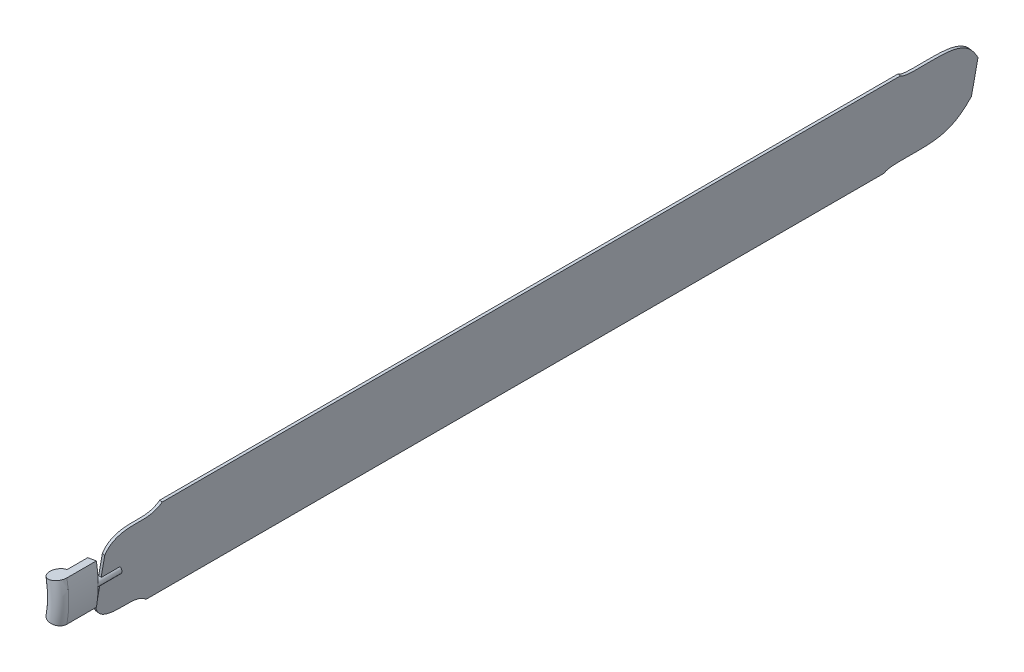
ISO-10303-21;
HEADER;
FILE_DESCRIPTION(('STEP AP214'),'2;1');
FILE_NAME('part.step','',(''),(''),'','','');
FILE_SCHEMA(('AUTOMOTIVE_DESIGN { 1 0 10303 214 1 1 1 1 }'));
ENDSEC;
DATA;
#1=APPLICATION_CONTEXT('core data for automotive mechanical design processes');
#2=APPLICATION_PROTOCOL_DEFINITION('international standard','automotive_design',2000,#1);
#3=PRODUCT_CONTEXT('',#1,'mechanical');
#4=PRODUCT('Part','Part','',(#3));
#5=PRODUCT_RELATED_PRODUCT_CATEGORY('part','',(#4));
#6=PRODUCT_DEFINITION_FORMATION('','',#4);
#7=PRODUCT_DEFINITION_CONTEXT('part definition',#1,'design');
#8=PRODUCT_DEFINITION('design','',#6,#7);
#9=PRODUCT_DEFINITION_SHAPE('','',#8);
#10=(LENGTH_UNIT() NAMED_UNIT(*) SI_UNIT(.MILLI.,.METRE.));
#11=(NAMED_UNIT(*) PLANE_ANGLE_UNIT() SI_UNIT($,.RADIAN.));
#12=(NAMED_UNIT(*) SI_UNIT($,.STERADIAN.) SOLID_ANGLE_UNIT());
#13=UNCERTAINTY_MEASURE_WITH_UNIT(LENGTH_MEASURE(1.E-05),#10,'distance_accuracy_value','');
#14=(GEOMETRIC_REPRESENTATION_CONTEXT(3) GLOBAL_UNCERTAINTY_ASSIGNED_CONTEXT((#13)) GLOBAL_UNIT_ASSIGNED_CONTEXT((#10,
#11,#12)) REPRESENTATION_CONTEXT('',''));
#15=CARTESIAN_POINT('',(0.,0.,0.));
#16=DIRECTION('',(0.,0.,1.));
#17=DIRECTION('',(1.,0.,0.));
#18=AXIS2_PLACEMENT_3D('',#15,#16,#17);
#19=CARTESIAN_POINT('',(45.8916588229934,29.4562575543292,16.4977824517042));
#20=DIRECTION('',(-0.984807753012209,0.173648177666928,0.));
#21=DIRECTION('',(-0.173648177666928,-0.984807753012209,0.));
#22=AXIS2_PLACEMENT_3D('',#19,#20,#21);
#23=PLANE('',#22);
#24=CARTESIAN_POINT('',(41.0814453886609,2.17618155571783,-351.502217548296));
#25=CARTESIAN_POINT('',(40.0405630877971,-3.72695531353289,-347.967875432127));
#26=CARTESIAN_POINT('',(38.4755583622352,-12.602538161228,-336.774418039819));
#27=CARTESIAN_POINT('',(39.9916376862148,-4.00442505404396,-305.302673092351));
#28=CARTESIAN_POINT('',(37.3452628748744,-19.0127624094933,-323.695897101064));
#29=B_SPLINE_CURVE_WITH_KNOTS('',3,(#24,#25,#26,#27,#28),.UNSPECIFIED.,.F.,.F.,(4,1,4),(0.,
0.348264383579403,1.),.UNSPECIFIED.);
#30=CARTESIAN_POINT('',(39.0236725336993,-9.49402822552852,-316.754779296154));
#31=VERTEX_POINT('',#30);
#32=CARTESIAN_POINT('',(41.0814453886609,2.17618155571783,-351.502217548296));
#33=VERTEX_POINT('',#32);
#34=EDGE_CURVE('E151',#31,#33,#29,.F.);
#35=ORIENTED_EDGE('',*,*,#34,.F.);
#36=DIRECTION('',(0.,0.,-1.));
#37=VECTOR('',#36,1.);
#38=CARTESIAN_POINT('',(39.0236725336993,-9.49402822552851,16.4977824517042));
#39=LINE('',#38,#37);
#40=CARTESIAN_POINT('',(39.0236725336993,-9.49402822552851,-6.10081257353363));
#41=VERTEX_POINT('',#40);
#42=EDGE_CURVE('E161',#41,#31,#39,.T.);
#43=ORIENTED_EDGE('',*,*,#42,.F.);
#44=CARTESIAN_POINT('',(40.5945146896673,-0.585339664897899,16.4977824517042));
#45=CARTESIAN_POINT('',(39.8668225466336,-4.71228688596365,15.1194466914543));
#46=CARTESIAN_POINT('',(39.4798316785515,-6.90702116047601,9.53361709706314));
#47=CARTESIAN_POINT('',(39.5488932591807,-6.5153534738195,2.34707738003175));
#48=CARTESIAN_POINT('',(39.4875434939874,-6.86328528179826,-2.58281750213995));
#49=CARTESIAN_POINT('',(38.8097567093769,-10.707205150937,-8.59504402973436));
#50=CARTESIAN_POINT('',(37.6367571009915,-17.3596165043915,-9.39942359034055));
#51=CARTESIAN_POINT('',(37.8995653008962,-15.8691571382258,-14.8364224951667));
#52=B_SPLINE_CURVE_WITH_KNOTS('',3,(#44,#45,#46,#47,#48,#49,#50,#51),.UNSPECIFIED.,.F.,.F.,(4,1,
1,1,1,4),(0.,0.299327732966461,0.443712894108735,0.582270155448302,0.686413384621787,1.),.UNSPECIFIED.);
#53=CARTESIAN_POINT('',(40.5945146896673,-0.585339664897808,16.4977824517042));
#54=VERTEX_POINT('',#53);
#55=EDGE_CURVE('E295',#41,#54,#52,.F.);
#56=ORIENTED_EDGE('',*,*,#55,.T.);
#57=DIRECTION('',(0.173648177666928,0.984807753012209,0.));
#58=VECTOR('',#57,1.);
#59=CARTESIAN_POINT('',(45.8916588229934,29.4562575543292,16.4977824517042));
#60=LINE('',#59,#58);
#61=CARTESIAN_POINT('',(42.2408611771756,8.75155523849963,16.4977824517042));
#62=VERTEX_POINT('',#61);
#63=EDGE_CURVE('E320',#54,#62,#60,.T.);
#64=ORIENTED_EDGE('',*,*,#63,.T.);
#65=DIRECTION('',(0.,0.,1.));
#66=VECTOR('',#65,1.);
#67=CARTESIAN_POINT('',(42.2408611771756,8.75155523849963,8.49778245170418));
#68=LINE('',#67,#66);
#69=CARTESIAN_POINT('',(42.2408611771756,8.75155523849963,8.49778245170418));
#70=VERTEX_POINT('',#69);
#71=EDGE_CURVE('E190',#70,#62,#68,.T.);
#72=ORIENTED_EDGE('',*,*,#71,.F.);
#73=DIRECTION('',(0.173648177666928,0.984807753012209,0.));
#74=VECTOR('',#73,1.);
#75=CARTESIAN_POINT('',(42.0636766257408,7.74669171322977,8.49778245170418));
#76=LINE('',#75,#74);
#77=CARTESIAN_POINT('',(42.7524109969001,11.6526984309317,8.49778245170418));
#78=VERTEX_POINT('',#77);
#79=EDGE_CURVE('E236',#70,#78,#76,.T.);
#80=ORIENTED_EDGE('',*,*,#79,.T.);
#81=DIRECTION('',(0.,0.,1.));
#82=VECTOR('',#81,1.);
#83=CARTESIAN_POINT('',(42.7524109969001,11.6526984309317,8.49778245170418));
#84=LINE('',#83,#82);
#85=CARTESIAN_POINT('',(42.7524109969001,11.6526984309317,16.4977824517042));
#86=VERTEX_POINT('',#85);
#87=EDGE_CURVE('E188',#86,#78,#84,.F.);
#88=ORIENTED_EDGE('',*,*,#87,.F.);
#89=CARTESIAN_POINT('',(44.3208166670253,20.5475689936984,16.4977824517042));
#90=VERTEX_POINT('',#89);
#91=EDGE_CURVE('E319',#86,#90,#60,.T.);
#92=ORIENTED_EDGE('',*,*,#91,.T.);
#93=CARTESIAN_POINT('',(44.3208166670253,20.5475689936985,16.4977824517042));
#94=CARTESIAN_POINT('',(45.048508810059,24.6745162147642,15.1194466914543));
#95=CARTESIAN_POINT('',(45.4354996781412,26.8692504892766,9.53361709706314));
#96=CARTESIAN_POINT('',(45.366438097512,26.4775828026201,2.34707738003175));
#97=CARTESIAN_POINT('',(45.4277878627053,26.8255146105988,-2.58281750213995));
#98=CARTESIAN_POINT('',(46.1055746473158,30.6694344797376,-8.59504402973435));
#99=CARTESIAN_POINT('',(47.2785742557011,37.321845833192,-9.39942359034055));
#100=CARTESIAN_POINT('',(47.0157660557965,35.8313864670263,-14.8364224951667));
#101=B_SPLINE_CURVE_WITH_KNOTS('',3,(#93,#94,#95,#96,#97,#98,#99,#100),.UNSPECIFIED.,.F.,.F.,(4,
1,1,1,1,4),(0.,0.299327732966461,0.443712894108735,0.582270155448302,0.686413384621787,1.),.UNSPECIFIED.);
#102=CARTESIAN_POINT('',(45.8916588229934,29.4562575543292,-6.10081257353379));
#103=VERTEX_POINT('',#102);
#104=EDGE_CURVE('E307',#103,#90,#101,.F.);
#105=ORIENTED_EDGE('',*,*,#104,.F.);
#106=DIRECTION('',(0.,0.,-1.));
#107=VECTOR('',#106,1.);
#108=CARTESIAN_POINT('',(45.8916588229934,29.4562575543292,16.4977824517042));
#109=LINE('',#108,#107);
#110=CARTESIAN_POINT('',(45.8916588229934,29.4562575543292,-316.754779296154));
#111=VERTEX_POINT('',#110);
#112=EDGE_CURVE('E183',#103,#111,#109,.T.);
#113=ORIENTED_EDGE('',*,*,#112,.T.);
#114=CARTESIAN_POINT('',(43.8338859680318,17.7860477730828,-351.502217548296));
#115=CARTESIAN_POINT('',(44.8747682688956,23.6891846423336,-347.967875432127));
#116=CARTESIAN_POINT('',(46.4397729944575,32.5647674900287,-336.774418039819));
#117=CARTESIAN_POINT('',(44.9236936704779,23.9666543828446,-305.302673092351));
#118=CARTESIAN_POINT('',(47.5700684818183,38.9749917382939,-323.695897101064));
#119=B_SPLINE_CURVE_WITH_KNOTS('',3,(#114,#115,#116,#117,#118),.UNSPECIFIED.,.F.,.F.,(4,1,4),
(0.,0.348264383579403,1.),.UNSPECIFIED.);
#120=CARTESIAN_POINT('',(43.8338859680318,17.7860477730828,-351.502217548296));
#121=VERTEX_POINT('',#120);
#122=EDGE_CURVE('E245',#111,#121,#119,.F.);
#123=ORIENTED_EDGE('',*,*,#122,.T.);
#124=DIRECTION('',(0.173648177666928,0.984807753012209,0.));
#125=VECTOR('',#124,1.);
#126=CARTESIAN_POINT('',(45.8916588229934,29.4562575543292,-351.502217548296));
#127=LINE('',#126,#125);
#128=EDGE_CURVE('E163',#33,#121,#127,.T.);
#129=ORIENTED_EDGE('',*,*,#128,.F.);
#130=EDGE_LOOP('',(#35,#43,#56,#64,#72,#80,#88,#92,#105,#113,#123,#129));
#131=FACE_BOUND('',#130,.T.);
#132=ADVANCED_FACE('F36',(#131),#23,.T.);
#133=CARTESIAN_POINT('',(46.9154369846971,29.2757378421607,16.4977824517042));
#134=DIRECTION('',(0.984807753012209,-0.173648177666928,0.));
#135=DIRECTION('',(0.173648177666928,0.984807753012209,0.));
#136=AXIS2_PLACEMENT_3D('',#133,#134,#135);
#137=PLANE('',#136);
#138=CARTESIAN_POINT('',(42.1052235503646,1.99566184354936,-351.502217548296));
#139=CARTESIAN_POINT('',(41.0643412495008,-3.90747502570137,-347.967875432127));
#140=CARTESIAN_POINT('',(39.4993365239389,-12.7830578733965,-336.774418039819));
#141=CARTESIAN_POINT('',(41.0154158479185,-4.18494476621244,-305.302673092351));
#142=CARTESIAN_POINT('',(38.3690410365781,-19.1932821216617,-323.695897101064));
#143=B_SPLINE_CURVE_WITH_KNOTS('',3,(#138,#139,#140,#141,#142),.UNSPECIFIED.,.F.,.F.,(4,1,4),
(0.,0.348264383579403,1.),.UNSPECIFIED.);
#144=CARTESIAN_POINT('',(42.1052235503646,1.99566184354935,-351.502217548296));
#145=VERTEX_POINT('',#144);
#146=CARTESIAN_POINT('',(40.047450695403,-9.67454793769699,-316.75477929177));
#147=VERTEX_POINT('',#146);
#148=EDGE_CURVE('E50',#145,#147,#143,.T.);
#149=ORIENTED_EDGE('',*,*,#148,.F.);
#150=DIRECTION('',(-0.173648177666928,-0.984807753012208,0.));
#151=VECTOR('',#150,1.);
#152=CARTESIAN_POINT('',(46.9154369846971,29.2757378421607,-351.502217548296));
#153=LINE('',#152,#151);
#154=CARTESIAN_POINT('',(44.8576641297356,17.6055280609143,-351.502217548296));
#155=VERTEX_POINT('',#154);
#156=EDGE_CURVE('E318',#155,#145,#153,.T.);
#157=ORIENTED_EDGE('',*,*,#156,.F.);
#158=CARTESIAN_POINT('',(44.8576641297356,17.6055280609143,-351.502217548296));
#159=CARTESIAN_POINT('',(45.8985464305994,23.5086649301651,-347.967875432127));
#160=CARTESIAN_POINT('',(47.4635511561612,32.3842477778602,-336.774418039819));
#161=CARTESIAN_POINT('',(45.9474718321816,23.7861346706761,-305.302673092351));
#162=CARTESIAN_POINT('',(48.593846643522,38.7944720261254,-323.695897101064));
#163=B_SPLINE_CURVE_WITH_KNOTS('',3,(#158,#159,#160,#161,#162),.UNSPECIFIED.,.F.,.F.,(4,1,4),
(0.,0.348264383579403,1.),.UNSPECIFIED.);
#164=CARTESIAN_POINT('',(46.9154369846971,29.2757378421607,-316.754779296154));
#165=VERTEX_POINT('',#164);
#166=EDGE_CURVE('E58',#155,#165,#163,.T.);
#167=ORIENTED_EDGE('',*,*,#166,.T.);
#168=DIRECTION('',(0.,0.,-1.));
#169=VECTOR('',#168,1.);
#170=CARTESIAN_POINT('',(46.9154369846971,29.2757378421607,16.4977824517042));
#171=LINE('',#170,#169);
#172=CARTESIAN_POINT('',(46.9154369846971,29.2757378421607,-6.10081257353374));
#173=VERTEX_POINT('',#172);
#174=EDGE_CURVE('E175',#173,#165,#171,.T.);
#175=ORIENTED_EDGE('',*,*,#174,.F.);
#176=CARTESIAN_POINT('',(45.3445948287291,20.36704928153,16.4977824517042));
#177=CARTESIAN_POINT('',(46.0722869717628,24.4939965025957,15.1194466914543));
#178=CARTESIAN_POINT('',(46.4592778398449,26.6887307771081,9.53361709706314));
#179=CARTESIAN_POINT('',(46.3902162592157,26.2970630904516,2.34707738003175));
#180=CARTESIAN_POINT('',(46.451566024409,26.6449948984303,-2.58281750213995));
#181=CARTESIAN_POINT('',(47.1293528090195,30.4889147675691,-8.59504402973435));
#182=CARTESIAN_POINT('',(48.3023524174049,37.1413261210236,-9.39942359034055));
#183=CARTESIAN_POINT('',(48.0395442175002,35.6508667548579,-14.8364224951667));
#184=B_SPLINE_CURVE_WITH_KNOTS('',3,(#176,#177,#178,#179,#180,#181,#182,#183),.UNSPECIFIED.,.F.,
.F.,(4,1,1,1,1,4),(0.,0.299327732966461,0.443712894108735,0.582270155448302,0.686413384621787,
1.),.UNSPECIFIED.);
#185=CARTESIAN_POINT('',(45.3445948287291,20.36704928153,16.4977824517042));
#186=VERTEX_POINT('',#185);
#187=EDGE_CURVE('E303',#186,#173,#184,.T.);
#188=ORIENTED_EDGE('',*,*,#187,.F.);
#189=DIRECTION('',(-0.173648177666928,-0.984807753012208,0.));
#190=VECTOR('',#189,1.);
#191=CARTESIAN_POINT('',(46.9154369846971,29.2757378421607,16.4977824517042));
#192=LINE('',#191,#190);
#193=CARTESIAN_POINT('',(43.773752672761,11.4583607208993,16.4977824517042));
#194=VERTEX_POINT('',#193);
#195=EDGE_CURVE('E178',#186,#194,#192,.T.);
#196=ORIENTED_EDGE('',*,*,#195,.T.);
#197=DIRECTION('',(0.,0.,1.));
#198=VECTOR('',#197,1.);
#199=CARTESIAN_POINT('',(43.773752672761,11.4583607208993,8.49778245170418));
#200=LINE('',#199,#198);
#201=CARTESIAN_POINT('',(43.773752672761,11.4583607208993,8.49778245170418));
#202=VERTEX_POINT('',#201);
#203=EDGE_CURVE('E173',#202,#194,#200,.T.);
#204=ORIENTED_EDGE('',*,*,#203,.F.);
#205=DIRECTION('',(-0.173648177666928,-0.984807753012209,0.));
#206=VECTOR('',#205,1.);
#207=CARTESIAN_POINT('',(43.0874547874445,7.56617200106129,8.49778245170418));
#208=LINE('',#207,#206);
#209=CARTESIAN_POINT('',(43.2670758247222,8.58485352419509,8.49778245170418));
#210=VERTEX_POINT('',#209);
#211=EDGE_CURVE('E233',#202,#210,#208,.T.);
#212=ORIENTED_EDGE('',*,*,#211,.T.);
#213=DIRECTION('',(0.,0.,1.));
#214=VECTOR('',#213,1.);
#215=CARTESIAN_POINT('',(43.2670758247222,8.58485352419509,8.49778245170418));
#216=LINE('',#215,#214);
#217=CARTESIAN_POINT('',(43.2670758247222,8.58485352419509,16.4977824517042));
#218=VERTEX_POINT('',#217);
#219=EDGE_CURVE('E169',#218,#210,#216,.F.);
#220=ORIENTED_EDGE('',*,*,#219,.F.);
#221=CARTESIAN_POINT('',(41.6182928513711,-0.765859377066286,16.4977824517042));
#222=VERTEX_POINT('',#221);
#223=EDGE_CURVE('E321',#218,#222,#192,.T.);
#224=ORIENTED_EDGE('',*,*,#223,.T.);
#225=CARTESIAN_POINT('',(41.6182928513711,-0.765859377066376,16.4977824517042));
#226=CARTESIAN_POINT('',(40.8906007083374,-4.89280659813213,15.1194466914543));
#227=CARTESIAN_POINT('',(40.5036098402552,-7.08754087264449,9.53361709706314));
#228=CARTESIAN_POINT('',(40.5726714208844,-6.69587318598797,2.34707738003175));
#229=CARTESIAN_POINT('',(40.5113216556911,-7.04380499396673,-2.58281750213995));
#230=CARTESIAN_POINT('',(39.8335348710806,-10.8877248631055,-8.59504402973436));
#231=CARTESIAN_POINT('',(38.6605352626953,-17.54013621656,-9.39942359034055));
#232=CARTESIAN_POINT('',(38.9233434625999,-16.0496768503942,-14.8364224951667));
#233=B_SPLINE_CURVE_WITH_KNOTS('',3,(#225,#226,#227,#228,#229,#230,#231,#232),.UNSPECIFIED.,.F.,
.F.,(4,1,1,1,1,4),(0.,0.299327732966461,0.443712894108735,0.582270155448302,0.686413384621787,
1.),.UNSPECIFIED.);
#234=CARTESIAN_POINT('',(40.047450695403,-9.67454793769699,-6.10081257353379));
#235=VERTEX_POINT('',#234);
#236=EDGE_CURVE('E255',#222,#235,#233,.T.);
#237=ORIENTED_EDGE('',*,*,#236,.T.);
#238=DIRECTION('',(0.,0.,-1.));
#239=VECTOR('',#238,1.);
#240=CARTESIAN_POINT('',(40.047450695403,-9.67454793769699,16.4977824517042));
#241=LINE('',#240,#239);
#242=EDGE_CURVE('E170',#235,#147,#241,.T.);
#243=ORIENTED_EDGE('',*,*,#242,.T.);
#244=EDGE_LOOP('',(#149,#157,#167,#175,#188,#196,#204,#212,#220,#224,#237,#243));
#245=FACE_BOUND('',#244,.T.);
#246=ADVANCED_FACE('F336',(#245),#137,.T.);
#247=CARTESIAN_POINT('',(45.8916588229934,29.4562575543292,16.4977824517042));
#248=DIRECTION('',(0.173648177666925,0.984807753012209,0.));
#249=DIRECTION('',(-0.984807753012209,0.173648177666925,0.));
#250=AXIS2_PLACEMENT_3D('',#247,#248,#249);
#251=PLANE('',#250);
#252=ORIENTED_EDGE('',*,*,#174,.T.);
#253=DIRECTION('',(0.984807753012209,-0.173648177666928,0.));
#254=VECTOR('',#253,1.);
#255=CARTESIAN_POINT('',(36.8188819741008,31.056032902736,-316.754779296154));
#256=LINE('',#255,#254);
#257=EDGE_CURVE('E164',#111,#165,#256,.T.);
#258=ORIENTED_EDGE('',*,*,#257,.F.);
#259=ORIENTED_EDGE('',*,*,#112,.F.);
#260=DIRECTION('',(0.984807753012208,-0.173648177666928,0.));
#261=VECTOR('',#260,1.);
#262=CARTESIAN_POINT('',(36.8188819741008,31.056032902736,-6.10081257353374));
#263=LINE('',#262,#261);
#264=EDGE_CURVE('E242',#173,#103,#263,.F.);
#265=ORIENTED_EDGE('',*,*,#264,.F.);
#266=EDGE_LOOP('',(#252,#258,#259,#265));
#267=FACE_BOUND('',#266,.T.);
#268=ADVANCED_FACE('F339',(#267),#251,.T.);
#269=CARTESIAN_POINT('',(39.0236725336993,-9.49402822552851,-351.502217548296));
#270=DIRECTION('',(0.,0.,1.));
#271=DIRECTION('',(1.,0.,0.));
#272=AXIS2_PLACEMENT_3D('',#269,#270,#271);
#273=PLANE('',#272);
#274=ORIENTED_EDGE('',*,*,#156,.T.);
#275=DIRECTION('',(0.984807753012209,-0.173648177666928,0.));
#276=VECTOR('',#275,1.);
#277=CARTESIAN_POINT('',(32.0086685397683,3.7759569041247,-351.502217548296));
#278=LINE('',#277,#276);
#279=EDGE_CURVE('E355',#33,#145,#278,.T.);
#280=ORIENTED_EDGE('',*,*,#279,.F.);
#281=ORIENTED_EDGE('',*,*,#128,.T.);
#282=DIRECTION('',(0.984807753012209,-0.173648177666928,0.));
#283=VECTOR('',#282,1.);
#284=CARTESIAN_POINT('',(34.7611091191392,19.3858231214897,-351.502217548296));
#285=LINE('',#284,#283);
#286=EDGE_CURVE('E44',#155,#121,#285,.F.);
#287=ORIENTED_EDGE('',*,*,#286,.F.);
#288=EDGE_LOOP('',(#274,#280,#281,#287));
#289=FACE_BOUND('',#288,.T.);
#290=ADVANCED_FACE('F288',(#289),#273,.F.);
#291=CARTESIAN_POINT('',(39.0236725336993,-9.49402822552851,16.4977824517042));
#292=DIRECTION('',(0.,0.,1.));
#293=DIRECTION('',(1.,0.,0.));
#294=AXIS2_PLACEMENT_3D('',#291,#292,#293);
#295=PLANE('',#294);
#296=ORIENTED_EDGE('',*,*,#63,.F.);
#297=DIRECTION('',(0.984807753012208,-0.173648177666928,0.));
#298=VECTOR('',#297,1.);
#299=CARTESIAN_POINT('',(31.5217378407748,1.01443568350906,16.4977824517042));
#300=LINE('',#299,#298);
#301=EDGE_CURVE('E252',#54,#222,#300,.T.);
#302=ORIENTED_EDGE('',*,*,#301,.T.);
#303=ORIENTED_EDGE('',*,*,#223,.F.);
#304=CARTESIAN_POINT('',(42.989039963544,10.1153027458822,16.4977824517042));
#305=DIRECTION('',(0.,0.,1.));
#306=DIRECTION('',(1.,0.,0.));
#307=AXIS2_PLACEMENT_3D('',#304,#305,#306);
#308=CIRCLE('',#307,1.55549952113903);
#309=EDGE_CURVE('E239',#62,#218,#308,.T.);
#310=ORIENTED_EDGE('',*,*,#309,.F.);
#311=EDGE_LOOP('',(#296,#302,#303,#310));
#312=FACE_BOUND('',#311,.T.);
#313=ADVANCED_FACE('F441',(#312),#295,.T.);
#314=CARTESIAN_POINT('',(39.0236725336993,-9.49402822552851,16.4977824517042));
#315=DIRECTION('',(-0.173648177666936,-0.984807753012207,0.));
#316=DIRECTION('',(0.984807753012207,-0.173648177666936,0.));
#317=AXIS2_PLACEMENT_3D('',#314,#315,#316);
#318=PLANE('',#317);
#319=DIRECTION('',(0.984807753012209,-0.173648177666928,0.));
#320=VECTOR('',#319,1.);
#321=CARTESIAN_POINT('',(29.9508956848068,-7.89425287712157,-316.75477929177));
#322=LINE('',#321,#320);
#323=EDGE_CURVE('E11',#147,#31,#322,.F.);
#324=ORIENTED_EDGE('',*,*,#323,.F.);
#325=ORIENTED_EDGE('',*,*,#242,.F.);
#326=DIRECTION('',(0.984807753012208,-0.173648177666928,0.));
#327=VECTOR('',#326,1.);
#328=CARTESIAN_POINT('',(29.9508956848068,-7.89425287712157,-6.10081257353363));
#329=LINE('',#328,#327);
#330=EDGE_CURVE('E168',#235,#41,#329,.F.);
#331=ORIENTED_EDGE('',*,*,#330,.T.);
#332=ORIENTED_EDGE('',*,*,#42,.T.);
#333=EDGE_LOOP('',(#324,#325,#331,#332));
#334=FACE_BOUND('',#333,.T.);
#335=ADVANCED_FACE('F167',(#334),#318,.T.);
#336=CARTESIAN_POINT('',(28.6306159385128,10.1153027458822,8.49778245170418));
#337=DIRECTION('',(0.,0.,-1.));
#338=DIRECTION('',(-1.,0.,0.));
#339=AXIS2_PLACEMENT_3D('',#336,#337,#338);
#340=PLANE('',#339);
#341=ORIENTED_EDGE('',*,*,#79,.F.);
#342=CARTESIAN_POINT('',(42.989039963544,10.1153027458822,8.49778245170418));
#343=DIRECTION('',(0.,0.,-1.));
#344=DIRECTION('',(-1.,0.,0.));
#345=AXIS2_PLACEMENT_3D('',#342,#343,#344);
#346=CIRCLE('',#345,1.55549952113903);
#347=EDGE_CURVE('E194',#70,#78,#346,.T.);
#348=ORIENTED_EDGE('',*,*,#347,.T.);
#349=EDGE_LOOP('',(#341,#348));
#350=FACE_BOUND('',#349,.T.);
#351=ADVANCED_FACE('F383',(#350),#340,.T.);
#352=CARTESIAN_POINT('',(-4.14553428484692,10.1153027458822,30.8848019131057));
#353=DIRECTION('',(0.,0.,1.));
#354=DIRECTION('',(1.,0.,0.));
#355=AXIS2_PLACEMENT_3D('',#352,#353,#354);
#356=TOROIDAL_SURFACE('',#355,44.9999985143405,3.69007525518944);
#357=CARTESIAN_POINT('',(-4.14553428484691,10.1153027458822,30.8848019131057));
#358=DIRECTION('',(0.,0.,1.));
#359=DIRECTION('',(1.,0.,0.));
#360=AXIS2_PLACEMENT_3D('',#357,#358,#359);
#361=CIRCLE('',#360,48.6900737695299);
#362=CARTESIAN_POINT('',(43.8048278581225,1.6603601653349,30.8848019131057));
#363=VERTEX_POINT('',#362);
#364=CARTESIAN_POINT('',(43.8048278581225,18.5702453264295,30.8848019131057));
#365=VERTEX_POINT('',#364);
#366=EDGE_CURVE('E231',#363,#365,#361,.T.);
#367=ORIENTED_EDGE('',*,*,#366,.T.);
#368=CARTESIAN_POINT('',(40.1708131376134,17.929470482912,30.8848019131057));
#369=DIRECTION('',(-0.173648177666931,0.984807753012208,0.));
#370=DIRECTION('',(0.,0.,1.));
#371=AXIS2_PLACEMENT_3D('',#368,#369,#370);
#372=CIRCLE('',#371,3.69007525518944);
#373=CARTESIAN_POINT('',(40.1708131376134,17.929470482912,27.1947266579162));
#374=VERTEX_POINT('',#373);
#375=EDGE_CURVE('E200',#374,#365,#372,.T.);
#376=ORIENTED_EDGE('',*,*,#375,.F.);
#377=CARTESIAN_POINT('',(-4.14553428484691,10.1153027458822,27.1947266579163));
#378=DIRECTION('',(0.,0.,1.));
#379=DIRECTION('',(1.,0.,0.));
#380=AXIS2_PLACEMENT_3D('',#377,#378,#379);
#381=CIRCLE('',#380,44.9999985143405);
#382=CARTESIAN_POINT('',(40.1708131376134,2.30113500885238,27.1947266579162));
#383=VERTEX_POINT('',#382);
#384=EDGE_CURVE('E224',#383,#374,#381,.T.);
#385=ORIENTED_EDGE('',*,*,#384,.F.);
#386=CARTESIAN_POINT('',(40.1708131376134,2.30113500885238,30.8848019131057));
#387=DIRECTION('',(0.173648177666931,0.984807753012208,0.));
#388=DIRECTION('',(0.,0.,1.));
#389=AXIS2_PLACEMENT_3D('',#386,#387,#388);
#390=CIRCLE('',#389,3.69007525518944);
#391=EDGE_CURVE('E212',#383,#363,#390,.T.);
#392=ORIENTED_EDGE('',*,*,#391,.T.);
#393=EDGE_LOOP('',(#367,#376,#385,#392));
#394=FACE_BOUND('',#393,.T.);
#395=ADVANCED_FACE('F397',(#394),#356,.T.);
#396=CARTESIAN_POINT('',(-4.14553428484691,10.1153027458822,34.5848019131057));
#397=DIRECTION('',(0.,0.,1.));
#398=DIRECTION('',(1.,0.,0.));
#399=AXIS2_PLACEMENT_3D('',#396,#397,#398);
#400=CYLINDRICAL_SURFACE('',#399,48.6900737695299);
#401=CARTESIAN_POINT('',(-4.14553428484691,10.1153027458822,18.4977824517042));
#402=DIRECTION('',(0.,0.,1.));
#403=DIRECTION('',(1.,0.,0.));
#404=AXIS2_PLACEMENT_3D('',#401,#402,#403);
#405=CIRCLE('',#404,48.6900737695299);
#406=CARTESIAN_POINT('',(43.8048278581225,1.6603601653349,18.4977824517042));
#407=VERTEX_POINT('',#406);
#408=CARTESIAN_POINT('',(44.544539484683,10.1153027458822,18.4977824517042));
#409=VERTEX_POINT('',#408);
#410=EDGE_CURVE('E229',#407,#409,#405,.T.);
#411=ORIENTED_EDGE('',*,*,#410,.T.);
#412=CARTESIAN_POINT('',(43.8048278581225,18.5702453264295,18.4977824517042));
#413=VERTEX_POINT('',#412);
#414=EDGE_CURVE('E228',#409,#413,#405,.T.);
#415=ORIENTED_EDGE('',*,*,#414,.T.);
#416=DIRECTION('',(0.,0.,-1.));
#417=VECTOR('',#416,1.);
#418=CARTESIAN_POINT('',(43.8048278581225,18.5702453264295,32.6086476428035));
#419=LINE('',#418,#417);
#420=EDGE_CURVE('E203',#365,#413,#419,.T.);
#421=ORIENTED_EDGE('',*,*,#420,.F.);
#422=ORIENTED_EDGE('',*,*,#366,.F.);
#423=DIRECTION('',(0.,0.,-1.));
#424=VECTOR('',#423,1.);
#425=CARTESIAN_POINT('',(43.8048278581225,1.6603601653349,32.6086476428035));
#426=LINE('',#425,#424);
#427=EDGE_CURVE('E215',#363,#407,#426,.T.);
#428=ORIENTED_EDGE('',*,*,#427,.T.);
#429=EDGE_LOOP('',(#411,#415,#421,#422,#428));
#430=FACE_BOUND('',#429,.T.);
#431=ADVANCED_FACE('F38',(#430),#400,.T.);
#432=CARTESIAN_POINT('',(-83.1719222516251,24.04978713236,18.4977824517042));
#433=DIRECTION('',(0.,0.,-1.));
#434=DIRECTION('',(-1.,0.,0.));
#435=AXIS2_PLACEMENT_3D('',#432,#433,#434);
#436=PLANE('',#435);
#437=ORIENTED_EDGE('',*,*,#414,.F.);
#438=CARTESIAN_POINT('',(42.989039963544,10.1153027458822,18.4977824517042));
#439=DIRECTION('',(0.,0.,-1.));
#440=DIRECTION('',(-1.,0.,0.));
#441=AXIS2_PLACEMENT_3D('',#438,#439,#440);
#442=CIRCLE('',#441,1.55549952113903);
#443=EDGE_CURVE('E193',#409,#409,#442,.T.);
#444=ORIENTED_EDGE('',*,*,#443,.F.);
#445=ORIENTED_EDGE('',*,*,#410,.F.);
#446=DIRECTION('',(-0.984807753012208,0.173648177666931,0.));
#447=VECTOR('',#446,1.);
#448=CARTESIAN_POINT('',(-83.1719222516251,24.04978713236,18.4977824517042));
#449=LINE('',#448,#447);
#450=CARTESIAN_POINT('',(40.1708131376134,2.30113500885238,18.4977824517042));
#451=VERTEX_POINT('',#450);
#452=EDGE_CURVE('E218',#407,#451,#449,.T.);
#453=ORIENTED_EDGE('',*,*,#452,.T.);
#454=CARTESIAN_POINT('',(-4.14553428484691,10.1153027458822,18.4977824517042));
#455=DIRECTION('',(0.,0.,1.));
#456=DIRECTION('',(1.,0.,0.));
#457=AXIS2_PLACEMENT_3D('',#454,#455,#456);
#458=CIRCLE('',#457,44.9999985143405);
#459=CARTESIAN_POINT('',(40.1708131376134,17.929470482912,18.4977824517042));
#460=VERTEX_POINT('',#459);
#461=EDGE_CURVE('E226',#451,#460,#458,.T.);
#462=ORIENTED_EDGE('',*,*,#461,.T.);
#463=DIRECTION('',(-0.984807753012208,-0.173648177666931,0.));
#464=VECTOR('',#463,1.);
#465=CARTESIAN_POINT('',(-83.1719222516251,-3.8191816405956,18.4977824517042));
#466=LINE('',#465,#464);
#467=EDGE_CURVE('E206',#413,#460,#466,.T.);
#468=ORIENTED_EDGE('',*,*,#467,.F.);
#469=EDGE_LOOP('',(#437,#444,#445,#453,#462,#468));
#470=FACE_BOUND('',#469,.T.);
#471=ADVANCED_FACE('F396',(#470),#436,.T.);
#472=CARTESIAN_POINT('',(-4.14553428484691,10.1153027458822,34.5848019131057));
#473=DIRECTION('',(0.,0.,1.));
#474=DIRECTION('',(1.,0.,0.));
#475=AXIS2_PLACEMENT_3D('',#472,#473,#474);
#476=CYLINDRICAL_SURFACE('',#475,44.9999985143405);
#477=DIRECTION('',(0.,0.,1.));
#478=VECTOR('',#477,1.);
#479=CARTESIAN_POINT('',(40.1708131376134,2.30113500885238,32.6086476428035));
#480=LINE('',#479,#478);
#481=EDGE_CURVE('E221',#451,#383,#480,.T.);
#482=ORIENTED_EDGE('',*,*,#481,.T.);
#483=ORIENTED_EDGE('',*,*,#384,.T.);
#484=DIRECTION('',(0.,0.,1.));
#485=VECTOR('',#484,1.);
#486=CARTESIAN_POINT('',(40.1708131376134,17.929470482912,32.6086476428035));
#487=LINE('',#486,#485);
#488=EDGE_CURVE('E209',#460,#374,#487,.T.);
#489=ORIENTED_EDGE('',*,*,#488,.F.);
#490=ORIENTED_EDGE('',*,*,#461,.F.);
#491=EDGE_LOOP('',(#482,#483,#489,#490));
#492=FACE_BOUND('',#491,.T.);
#493=ADVANCED_FACE('F392',(#492),#476,.F.);
#494=CARTESIAN_POINT('',(-83.1719222516251,24.04978713236,32.6086476428035));
#495=DIRECTION('',(0.173648177666931,0.984807753012208,0.));
#496=DIRECTION('',(0.,0.,1.));
#497=AXIS2_PLACEMENT_3D('',#494,#495,#496);
#498=PLANE('',#497);
#499=ORIENTED_EDGE('',*,*,#391,.F.);
#500=ORIENTED_EDGE('',*,*,#481,.F.);
#501=ORIENTED_EDGE('',*,*,#452,.F.);
#502=ORIENTED_EDGE('',*,*,#427,.F.);
#503=EDGE_LOOP('',(#499,#500,#501,#502));
#504=FACE_BOUND('',#503,.T.);
#505=ADVANCED_FACE('F390',(#504),#498,.F.);
#506=CARTESIAN_POINT('',(-83.1719222516251,-3.8191816405956,32.6086476428035));
#507=DIRECTION('',(-0.173648177666931,0.984807753012208,0.));
#508=DIRECTION('',(0.,0.,1.));
#509=AXIS2_PLACEMENT_3D('',#506,#507,#508);
#510=PLANE('',#509);
#511=ORIENTED_EDGE('',*,*,#375,.T.);
#512=ORIENTED_EDGE('',*,*,#420,.T.);
#513=ORIENTED_EDGE('',*,*,#467,.T.);
#514=ORIENTED_EDGE('',*,*,#488,.T.);
#515=EDGE_LOOP('',(#511,#512,#513,#514));
#516=FACE_BOUND('',#515,.T.);
#517=ADVANCED_FACE('F386',(#516),#510,.T.);
#518=CARTESIAN_POINT('',(42.989039963544,10.1153027458822,8.49778245170418));
#519=DIRECTION('',(0.,0.,1.));
#520=DIRECTION('',(1.,0.,0.));
#521=AXIS2_PLACEMENT_3D('',#518,#519,#520);
#522=CYLINDRICAL_SURFACE('',#521,1.55549952113903);
#523=EDGE_CURVE('E241',#194,#86,#308,.T.);
#524=ORIENTED_EDGE('',*,*,#523,.T.);
#525=ORIENTED_EDGE('',*,*,#87,.T.);
#526=ORIENTED_EDGE('',*,*,#347,.F.);
#527=ORIENTED_EDGE('',*,*,#71,.T.);
#528=ORIENTED_EDGE('',*,*,#309,.T.);
#529=ORIENTED_EDGE('',*,*,#219,.T.);
#530=EDGE_CURVE('E197',#202,#210,#346,.T.);
#531=ORIENTED_EDGE('',*,*,#530,.F.);
#532=ORIENTED_EDGE('',*,*,#203,.T.);
#533=EDGE_LOOP('',(#524,#525,#526,#527,#528,#529,#531,#532));
#534=FACE_BOUND('',#533,.T.);
#535=ORIENTED_EDGE('',*,*,#443,.T.);
#536=EDGE_LOOP('',(#535));
#537=FACE_BOUND('',#536,.T.);
#538=ADVANCED_FACE('F381',(#534,#537),#522,.T.);
#539=ORIENTED_EDGE('',*,*,#211,.F.);
#540=ORIENTED_EDGE('',*,*,#530,.T.);
#541=EDGE_LOOP('',(#539,#540));
#542=FACE_BOUND('',#541,.T.);
#543=ADVANCED_FACE('F378',(#542),#340,.T.);
#544=DIRECTION('',(0.984807753012208,-0.173648177666928,0.));
#545=VECTOR('',#544,1.);
#546=CARTESIAN_POINT('',(35.2480398181328,22.1473443421053,16.4977824517042));
#547=LINE('',#546,#545);
#548=EDGE_CURVE('E298',#90,#186,#547,.T.);
#549=ORIENTED_EDGE('',*,*,#548,.F.);
#550=ORIENTED_EDGE('',*,*,#91,.F.);
#551=ORIENTED_EDGE('',*,*,#523,.F.);
#552=ORIENTED_EDGE('',*,*,#195,.F.);
#553=EDGE_LOOP('',(#549,#550,#551,#552));
#554=FACE_BOUND('',#553,.T.);
#555=ADVANCED_FACE('F286',(#554),#295,.T.);
#556=CARTESIAN_POINT('',(35.2480398181327,22.1473443421053,16.4977824517042));
#557=CARTESIAN_POINT('',(35.9757319611664,26.2742915631711,15.1194466914543));
#558=CARTESIAN_POINT('',(36.3627228292486,28.4690258376834,9.53361709706314));
#559=CARTESIAN_POINT('',(36.2936612486194,28.0773581510269,2.34707738003175));
#560=CARTESIAN_POINT('',(36.3550110138127,28.4252899590057,-2.58281750213995));
#561=CARTESIAN_POINT('',(37.0327977984232,32.2692098281445,-8.59504402973435));
#562=CARTESIAN_POINT('',(38.2057974068085,38.9216211815989,-9.39942359034055));
#563=CARTESIAN_POINT('',(37.9429892069039,37.4311618154332,-14.8364224951667));
#564=B_SPLINE_CURVE_WITH_KNOTS('',3,(#556,#557,#558,#559,#560,#561,#562,#563),.UNSPECIFIED.,.F.,
.F.,(4,1,1,1,1,4),(0.,0.299327732966461,0.443712894108735,0.582270155448302,0.686413384621787,
1.),.UNSPECIFIED.);
#565=DIRECTION('',(0.984807753012208,-0.173648177666928,0.));
#566=VECTOR('',#565,1.);
#567=SURFACE_OF_LINEAR_EXTRUSION('',#564,#566);
#568=ORIENTED_EDGE('',*,*,#104,.T.);
#569=ORIENTED_EDGE('',*,*,#548,.T.);
#570=ORIENTED_EDGE('',*,*,#187,.T.);
#571=ORIENTED_EDGE('',*,*,#264,.T.);
#572=EDGE_LOOP('',(#568,#569,#570,#571));
#573=FACE_BOUND('',#572,.T.);
#574=ADVANCED_FACE('F279',(#573),#567,.F.);
#575=CARTESIAN_POINT('',(31.5217378407747,1.01443568350897,16.4977824517042));
#576=CARTESIAN_POINT('',(30.794045697741,-3.11251153755679,15.1194466914543));
#577=CARTESIAN_POINT('',(30.4070548296589,-5.30724581206915,9.53361709706314));
#578=CARTESIAN_POINT('',(30.4761164102881,-4.91557812541263,2.34707738003175));
#579=CARTESIAN_POINT('',(30.4147666450948,-5.26350993339139,-2.58281750213995));
#580=CARTESIAN_POINT('',(29.7369798604843,-9.10742980253017,-8.59504402973436));
#581=CARTESIAN_POINT('',(28.5639802520989,-15.7598411559846,-9.39942359034055));
#582=CARTESIAN_POINT('',(28.8267884520036,-14.2693817898189,-14.8364224951667));
#583=B_SPLINE_CURVE_WITH_KNOTS('',3,(#575,#576,#577,#578,#579,#580,#581,#582),.UNSPECIFIED.,.F.,
.F.,(4,1,1,1,1,4),(0.,0.299327732966461,0.443712894108735,0.582270155448302,0.686413384621787,
1.),.UNSPECIFIED.);
#584=DIRECTION('',(0.984807753012208,-0.173648177666928,0.));
#585=VECTOR('',#584,1.);
#586=SURFACE_OF_LINEAR_EXTRUSION('',#583,#585);
#587=ORIENTED_EDGE('',*,*,#330,.F.);
#588=ORIENTED_EDGE('',*,*,#236,.F.);
#589=ORIENTED_EDGE('',*,*,#301,.F.);
#590=ORIENTED_EDGE('',*,*,#55,.F.);
#591=EDGE_LOOP('',(#587,#588,#589,#590));
#592=FACE_BOUND('',#591,.T.);
#593=ADVANCED_FACE('F275',(#592),#586,.T.);
#594=CARTESIAN_POINT('',(34.7611091191392,19.3858231214897,-351.502217548296));
#595=CARTESIAN_POINT('',(35.801991420003,25.2889599907404,-347.967875432127));
#596=CARTESIAN_POINT('',(37.3669961455649,34.1645428384355,-336.774418039819));
#597=CARTESIAN_POINT('',(35.8509168215853,25.5664297312515,-305.302673092351));
#598=CARTESIAN_POINT('',(38.4972916329257,40.5747670867007,-323.695897101064));
#599=B_SPLINE_CURVE_WITH_KNOTS('',3,(#594,#595,#596,#597,#598),.UNSPECIFIED.,.F.,.F.,(4,1,4),
(0.,0.348264383579403,1.),.UNSPECIFIED.);
#600=DIRECTION('',(0.984807753012209,-0.173648177666928,0.));
#601=VECTOR('',#600,1.);
#602=SURFACE_OF_LINEAR_EXTRUSION('',#599,#601);
#603=ORIENTED_EDGE('',*,*,#257,.T.);
#604=ORIENTED_EDGE('',*,*,#166,.F.);
#605=ORIENTED_EDGE('',*,*,#286,.T.);
#606=ORIENTED_EDGE('',*,*,#122,.F.);
#607=EDGE_LOOP('',(#603,#604,#605,#606));
#608=FACE_BOUND('',#607,.T.);
#609=ADVANCED_FACE('F244',(#608),#602,.T.);
#610=CARTESIAN_POINT('',(32.0086685397683,3.7759569041247,-351.502217548296));
#611=CARTESIAN_POINT('',(30.9677862389045,-2.12717996512603,-347.967875432127));
#612=CARTESIAN_POINT('',(29.4027815133426,-11.0027628128212,-336.774418039819));
#613=CARTESIAN_POINT('',(30.9188608373222,-2.4046497056371,-305.302673092351));
#614=CARTESIAN_POINT('',(28.2724860259818,-17.4129870610864,-323.695897101064));
#615=B_SPLINE_CURVE_WITH_KNOTS('',3,(#610,#611,#612,#613,#614),.UNSPECIFIED.,.F.,.F.,(4,1,4),
(0.,0.348264383579403,1.),.UNSPECIFIED.);
#616=DIRECTION('',(0.984807753012209,-0.173648177666928,0.));
#617=VECTOR('',#616,1.);
#618=SURFACE_OF_LINEAR_EXTRUSION('',#615,#617);
#619=ORIENTED_EDGE('',*,*,#34,.T.);
#620=ORIENTED_EDGE('',*,*,#279,.T.);
#621=ORIENTED_EDGE('',*,*,#148,.T.);
#622=ORIENTED_EDGE('',*,*,#323,.T.);
#623=EDGE_LOOP('',(#619,#620,#621,#622));
#624=FACE_BOUND('',#623,.T.);
#625=ADVANCED_FACE('F150',(#624),#618,.F.);
#626=CLOSED_SHELL('',(#132,#246,#268,#290,#313,#335,#351,#395,#431,#471,#493,#505,#517,#538,
#543,#555,#574,#593,#609,#625));
#627=MANIFOLD_SOLID_BREP('B2',#626);
#628=ADVANCED_BREP_SHAPE_REPRESENTATION('',(#18,#627),#14);
#629=SHAPE_DEFINITION_REPRESENTATION(#9,#628);
ENDSEC;
END-ISO-10303-21;
